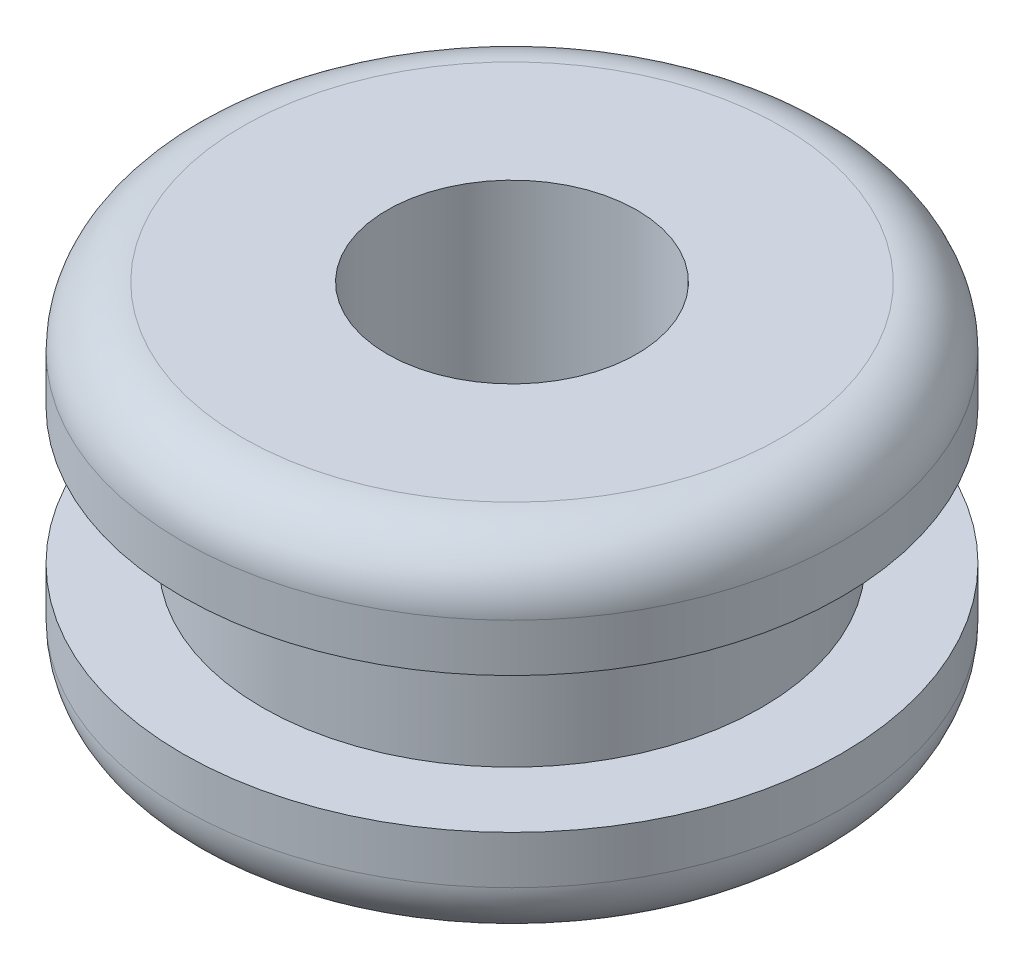
ISO-10303-21;
HEADER;
FILE_DESCRIPTION(('STEP AP214'),'2;1');
FILE_NAME('part.step','',(''),(''),'','','');
FILE_SCHEMA(('AUTOMOTIVE_DESIGN { 1 0 10303 214 1 1 1 1 }'));
ENDSEC;
DATA;
#1=APPLICATION_CONTEXT('core data for automotive mechanical design processes');
#2=APPLICATION_PROTOCOL_DEFINITION('international standard','automotive_design',2000,#1);
#3=PRODUCT_CONTEXT('',#1,'mechanical');
#4=PRODUCT('Part','Part','',(#3));
#5=PRODUCT_RELATED_PRODUCT_CATEGORY('part','',(#4));
#6=PRODUCT_DEFINITION_FORMATION('','',#4);
#7=PRODUCT_DEFINITION_CONTEXT('part definition',#1,'design');
#8=PRODUCT_DEFINITION('design','',#6,#7);
#9=PRODUCT_DEFINITION_SHAPE('','',#8);
#10=(LENGTH_UNIT() NAMED_UNIT(*) SI_UNIT(.MILLI.,.METRE.));
#11=(NAMED_UNIT(*) PLANE_ANGLE_UNIT() SI_UNIT($,.RADIAN.));
#12=(NAMED_UNIT(*) SI_UNIT($,.STERADIAN.) SOLID_ANGLE_UNIT());
#13=UNCERTAINTY_MEASURE_WITH_UNIT(LENGTH_MEASURE(1.E-05),#10,'distance_accuracy_value','');
#14=(GEOMETRIC_REPRESENTATION_CONTEXT(3) GLOBAL_UNCERTAINTY_ASSIGNED_CONTEXT((#13)) GLOBAL_UNIT_ASSIGNED_CONTEXT((#10,
#11,#12)) REPRESENTATION_CONTEXT('',''));
#15=CARTESIAN_POINT('',(0.,0.,0.));
#16=DIRECTION('',(0.,0.,1.));
#17=DIRECTION('',(1.,0.,0.));
#18=AXIS2_PLACEMENT_3D('',#15,#16,#17);
#19=CARTESIAN_POINT('',(0.,1.3716,0.));
#20=DIRECTION('',(0.,-1.,0.));
#21=DIRECTION('',(0.,0.,-1.));
#22=AXIS2_PLACEMENT_3D('',#19,#20,#21);
#23=CYLINDRICAL_SURFACE('',#22,4.191);
#24=CARTESIAN_POINT('',(0.,0.762,0.));
#25=DIRECTION('',(0.,1.,0.));
#26=DIRECTION('',(0.,0.,1.));
#27=AXIS2_PLACEMENT_3D('',#24,#25,#26);
#28=CIRCLE('',#27,4.191);
#29=CARTESIAN_POINT('',(0.,0.762,4.191));
#30=VERTEX_POINT('',#29);
#31=EDGE_CURVE('E38',#30,#30,#28,.T.);
#32=ORIENTED_EDGE('',*,*,#31,.T.);
#33=EDGE_LOOP('',(#32));
#34=FACE_BOUND('',#33,.T.);
#35=CARTESIAN_POINT('',(0.,1.3716,0.));
#36=DIRECTION('',(0.,1.,0.));
#37=DIRECTION('',(0.,0.,1.));
#38=AXIS2_PLACEMENT_3D('',#35,#36,#37);
#39=CIRCLE('',#38,4.191);
#40=CARTESIAN_POINT('',(0.,1.3716,4.191));
#41=VERTEX_POINT('',#40);
#42=EDGE_CURVE('E52',#41,#41,#39,.T.);
#43=ORIENTED_EDGE('',*,*,#42,.F.);
#44=EDGE_LOOP('',(#43));
#45=FACE_BOUND('',#44,.T.);
#46=ADVANCED_FACE('F31',(#34,#45),#23,.T.);
#47=CARTESIAN_POINT('',(0.,1.3716,0.));
#48=DIRECTION('',(0.,1.,0.));
#49=DIRECTION('',(0.,0.,1.));
#50=AXIS2_PLACEMENT_3D('',#47,#48,#49);
#51=PLANE('',#50);
#52=CARTESIAN_POINT('',(0.,1.3716,0.));
#53=DIRECTION('',(0.,1.,0.));
#54=DIRECTION('',(0.,0.,1.));
#55=AXIS2_PLACEMENT_3D('',#52,#53,#54);
#56=CIRCLE('',#55,3.175);
#57=CARTESIAN_POINT('',(0.,1.3716,3.175));
#58=VERTEX_POINT('',#57);
#59=EDGE_CURVE('E51',#58,#58,#56,.T.);
#60=ORIENTED_EDGE('',*,*,#59,.F.);
#61=EDGE_LOOP('',(#60));
#62=FACE_BOUND('',#61,.T.);
#63=ORIENTED_EDGE('',*,*,#42,.T.);
#64=EDGE_LOOP('',(#63));
#65=FACE_BOUND('',#64,.T.);
#66=ADVANCED_FACE('F95',(#62,#65),#51,.T.);
#67=CARTESIAN_POINT('',(0.,0.,0.));
#68=DIRECTION('',(0.,1.,0.));
#69=DIRECTION('',(0.,0.,1.));
#70=AXIS2_PLACEMENT_3D('',#67,#68,#69);
#71=PLANE('',#70);
#72=CARTESIAN_POINT('',(0.,0.,0.));
#73=DIRECTION('',(0.,1.,0.));
#74=DIRECTION('',(0.,0.,1.));
#75=AXIS2_PLACEMENT_3D('',#72,#73,#74);
#76=CIRCLE('',#75,3.429);
#77=CARTESIAN_POINT('',(0.,0.,3.429));
#78=VERTEX_POINT('',#77);
#79=EDGE_CURVE('E10',#78,#78,#76,.F.);
#80=ORIENTED_EDGE('',*,*,#79,.T.);
#81=EDGE_LOOP('',(#80));
#82=FACE_BOUND('',#81,.T.);
#83=CARTESIAN_POINT('',(0.,0.,0.));
#84=DIRECTION('',(0.,1.,0.));
#85=DIRECTION('',(0.,0.,1.));
#86=AXIS2_PLACEMENT_3D('',#83,#84,#85);
#87=CIRCLE('',#86,1.5875);
#88=CARTESIAN_POINT('',(0.,0.,1.5875));
#89=VERTEX_POINT('',#88);
#90=EDGE_CURVE('E63',#89,#89,#87,.T.);
#91=ORIENTED_EDGE('',*,*,#90,.T.);
#92=EDGE_LOOP('',(#91));
#93=FACE_BOUND('',#92,.T.);
#94=ADVANCED_FACE('F70',(#82,#93),#71,.F.);
#95=CARTESIAN_POINT('',(0.,3.0988,0.));
#96=DIRECTION('',(0.,-1.,0.));
#97=DIRECTION('',(0.,0.,-1.));
#98=AXIS2_PLACEMENT_3D('',#95,#96,#97);
#99=CYLINDRICAL_SURFACE('',#98,3.175);
#100=CARTESIAN_POINT('',(0.,3.0988,0.));
#101=DIRECTION('',(0.,1.,0.));
#102=DIRECTION('',(0.,0.,1.));
#103=AXIS2_PLACEMENT_3D('',#100,#101,#102);
#104=CIRCLE('',#103,3.175);
#105=CARTESIAN_POINT('',(0.,3.0988,3.175));
#106=VERTEX_POINT('',#105);
#107=EDGE_CURVE('E55',#106,#106,#104,.T.);
#108=ORIENTED_EDGE('',*,*,#107,.F.);
#109=EDGE_LOOP('',(#108));
#110=FACE_BOUND('',#109,.T.);
#111=ORIENTED_EDGE('',*,*,#59,.T.);
#112=EDGE_LOOP('',(#111));
#113=FACE_BOUND('',#112,.T.);
#114=ADVANCED_FACE('F91',(#110,#113),#99,.T.);
#115=CARTESIAN_POINT('',(0.,4.4704,0.));
#116=DIRECTION('',(0.,-1.,0.));
#117=DIRECTION('',(0.,0.,-1.));
#118=AXIS2_PLACEMENT_3D('',#115,#116,#117);
#119=CYLINDRICAL_SURFACE('',#118,4.191);
#120=CARTESIAN_POINT('',(0.,3.7084,0.));
#121=DIRECTION('',(0.,1.,0.));
#122=DIRECTION('',(0.,0.,1.));
#123=AXIS2_PLACEMENT_3D('',#120,#121,#122);
#124=CIRCLE('',#123,4.191);
#125=CARTESIAN_POINT('',(0.,3.7084,4.191));
#126=VERTEX_POINT('',#125);
#127=EDGE_CURVE('E42',#126,#126,#124,.F.);
#128=ORIENTED_EDGE('',*,*,#127,.T.);
#129=EDGE_LOOP('',(#128));
#130=FACE_BOUND('',#129,.T.);
#131=CARTESIAN_POINT('',(0.,3.0988,0.));
#132=DIRECTION('',(0.,1.,0.));
#133=DIRECTION('',(0.,0.,1.));
#134=AXIS2_PLACEMENT_3D('',#131,#132,#133);
#135=CIRCLE('',#134,4.191);
#136=CARTESIAN_POINT('',(0.,3.0988,4.191));
#137=VERTEX_POINT('',#136);
#138=EDGE_CURVE('E60',#137,#137,#135,.T.);
#139=ORIENTED_EDGE('',*,*,#138,.T.);
#140=EDGE_LOOP('',(#139));
#141=FACE_BOUND('',#140,.T.);
#142=ADVANCED_FACE('F82',(#130,#141),#119,.T.);
#143=CARTESIAN_POINT('',(0.,4.4704,0.));
#144=DIRECTION('',(0.,1.,0.));
#145=DIRECTION('',(0.,0.,1.));
#146=AXIS2_PLACEMENT_3D('',#143,#144,#145);
#147=PLANE('',#146);
#148=CARTESIAN_POINT('',(0.,4.4704,0.));
#149=DIRECTION('',(0.,1.,0.));
#150=DIRECTION('',(0.,0.,1.));
#151=AXIS2_PLACEMENT_3D('',#148,#149,#150);
#152=CIRCLE('',#151,3.429);
#153=CARTESIAN_POINT('',(0.,4.4704,3.429));
#154=VERTEX_POINT('',#153);
#155=EDGE_CURVE('E46',#154,#154,#152,.T.);
#156=ORIENTED_EDGE('',*,*,#155,.T.);
#157=EDGE_LOOP('',(#156));
#158=FACE_BOUND('',#157,.T.);
#159=CARTESIAN_POINT('',(0.,4.4704,0.));
#160=DIRECTION('',(0.,1.,0.));
#161=DIRECTION('',(0.,0.,1.));
#162=AXIS2_PLACEMENT_3D('',#159,#160,#161);
#163=CIRCLE('',#162,1.5875);
#164=CARTESIAN_POINT('',(0.,4.4704,1.5875));
#165=VERTEX_POINT('',#164);
#166=EDGE_CURVE('E64',#165,#165,#163,.T.);
#167=ORIENTED_EDGE('',*,*,#166,.F.);
#168=EDGE_LOOP('',(#167));
#169=FACE_BOUND('',#168,.T.);
#170=ADVANCED_FACE('F80',(#158,#169),#147,.T.);
#171=CARTESIAN_POINT('',(0.,3.0988,0.));
#172=DIRECTION('',(0.,1.,0.));
#173=DIRECTION('',(0.,0.,1.));
#174=AXIS2_PLACEMENT_3D('',#171,#172,#173);
#175=PLANE('',#174);
#176=ORIENTED_EDGE('',*,*,#107,.T.);
#177=EDGE_LOOP('',(#176));
#178=FACE_BOUND('',#177,.T.);
#179=ORIENTED_EDGE('',*,*,#138,.F.);
#180=EDGE_LOOP('',(#179));
#181=FACE_BOUND('',#180,.T.);
#182=ADVANCED_FACE('F76',(#178,#181),#175,.F.);
#183=CARTESIAN_POINT('',(0.,0.,0.));
#184=DIRECTION('',(0.,1.,0.));
#185=DIRECTION('',(0.,0.,1.));
#186=AXIS2_PLACEMENT_3D('',#183,#184,#185);
#187=CYLINDRICAL_SURFACE('',#186,1.5875);
#188=ORIENTED_EDGE('',*,*,#90,.F.);
#189=EDGE_LOOP('',(#188));
#190=FACE_BOUND('',#189,.T.);
#191=ORIENTED_EDGE('',*,*,#166,.T.);
#192=EDGE_LOOP('',(#191));
#193=FACE_BOUND('',#192,.T.);
#194=ADVANCED_FACE('F72',(#190,#193),#187,.F.);
#195=CARTESIAN_POINT('',(0.,3.7084,0.));
#196=DIRECTION('',(0.,1.,0.));
#197=DIRECTION('',(0.,0.,1.));
#198=AXIS2_PLACEMENT_3D('',#195,#196,#197);
#199=TOROIDAL_SURFACE('',#198,3.429,0.762);
#200=ORIENTED_EDGE('',*,*,#127,.F.);
#201=EDGE_LOOP('',(#200));
#202=FACE_BOUND('',#201,.T.);
#203=ORIENTED_EDGE('',*,*,#155,.F.);
#204=EDGE_LOOP('',(#203));
#205=FACE_BOUND('',#204,.T.);
#206=ADVANCED_FACE('F75',(#202,#205),#199,.T.);
#207=CARTESIAN_POINT('',(0.,0.762,0.));
#208=DIRECTION('',(0.,1.,0.));
#209=DIRECTION('',(0.,0.,1.));
#210=AXIS2_PLACEMENT_3D('',#207,#208,#209);
#211=TOROIDAL_SURFACE('',#210,3.429,0.762);
#212=ORIENTED_EDGE('',*,*,#79,.F.);
#213=EDGE_LOOP('',(#212));
#214=FACE_BOUND('',#213,.T.);
#215=ORIENTED_EDGE('',*,*,#31,.F.);
#216=EDGE_LOOP('',(#215));
#217=FACE_BOUND('',#216,.T.);
#218=ADVANCED_FACE('F33',(#214,#217),#211,.T.);
#219=CLOSED_SHELL('',(#46,#66,#94,#114,#142,#170,#182,#194,#206,#218));
#220=MANIFOLD_SOLID_BREP('B2',#219);
#221=ADVANCED_BREP_SHAPE_REPRESENTATION('',(#18,#220),#14);
#222=SHAPE_DEFINITION_REPRESENTATION(#9,#221);
ENDSEC;
END-ISO-10303-21;
